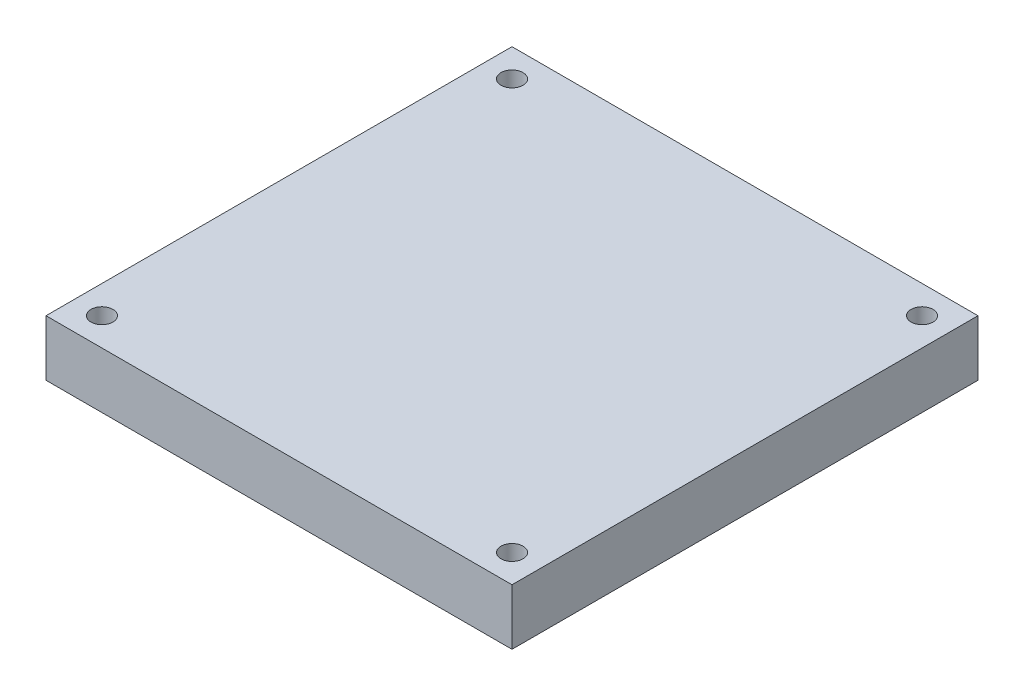
ISO-10303-21;
HEADER;
FILE_DESCRIPTION(('STEP AP214'),'2;1');
FILE_NAME('part.step','',(''),(''),'','','');
FILE_SCHEMA(('AUTOMOTIVE_DESIGN { 1 0 10303 214 1 1 1 1 }'));
ENDSEC;
DATA;
#1=APPLICATION_CONTEXT('core data for automotive mechanical design processes');
#2=APPLICATION_PROTOCOL_DEFINITION('international standard','automotive_design',2000,#1);
#3=PRODUCT_CONTEXT('',#1,'mechanical');
#4=PRODUCT('Part','Part','',(#3));
#5=PRODUCT_RELATED_PRODUCT_CATEGORY('part','',(#4));
#6=PRODUCT_DEFINITION_FORMATION('','',#4);
#7=PRODUCT_DEFINITION_CONTEXT('part definition',#1,'design');
#8=PRODUCT_DEFINITION('design','',#6,#7);
#9=PRODUCT_DEFINITION_SHAPE('','',#8);
#10=(LENGTH_UNIT() NAMED_UNIT(*) SI_UNIT(.MILLI.,.METRE.));
#11=(NAMED_UNIT(*) PLANE_ANGLE_UNIT() SI_UNIT($,.RADIAN.));
#12=(NAMED_UNIT(*) SI_UNIT($,.STERADIAN.) SOLID_ANGLE_UNIT());
#13=UNCERTAINTY_MEASURE_WITH_UNIT(LENGTH_MEASURE(1.E-05),#10,'distance_accuracy_value','');
#14=(GEOMETRIC_REPRESENTATION_CONTEXT(3) GLOBAL_UNCERTAINTY_ASSIGNED_CONTEXT((#13)) GLOBAL_UNIT_ASSIGNED_CONTEXT((#10,
#11,#12)) REPRESENTATION_CONTEXT('',''));
#15=CARTESIAN_POINT('',(0.,0.,0.));
#16=DIRECTION('',(0.,0.,1.));
#17=DIRECTION('',(1.,0.,0.));
#18=AXIS2_PLACEMENT_3D('',#15,#16,#17);
#19=CARTESIAN_POINT('',(-27.94,0.,-27.94));
#20=DIRECTION('',(0.,-1.,0.));
#21=DIRECTION('',(0.,0.,-1.));
#22=AXIS2_PLACEMENT_3D('',#19,#20,#21);
#23=CONICAL_SURFACE('',#22,1.525,0.785398163397388);
#24=CARTESIAN_POINT('',(-27.94,0.0250000000000003,-27.94));
#25=DIRECTION('',(0.,-1.,0.));
#26=DIRECTION('',(0.,0.,-1.));
#27=AXIS2_PLACEMENT_3D('',#24,#25,#26);
#28=CIRCLE('',#27,1.5);
#29=CARTESIAN_POINT('',(-27.94,0.0250000000000003,-29.44));
#30=VERTEX_POINT('',#29);
#31=EDGE_CURVE('E11',#30,#30,#28,.T.);
#32=ORIENTED_EDGE('',*,*,#31,.F.);
#33=EDGE_LOOP('',(#32));
#34=FACE_BOUND('',#33,.T.);
#35=CARTESIAN_POINT('',(-27.94,0.,-27.94));
#36=DIRECTION('',(0.,-1.,0.));
#37=DIRECTION('',(0.,0.,-1.));
#38=AXIS2_PLACEMENT_3D('',#35,#36,#37);
#39=CIRCLE('',#38,1.525);
#40=CARTESIAN_POINT('',(-27.94,0.,-29.465));
#41=VERTEX_POINT('',#40);
#42=EDGE_CURVE('E145',#41,#41,#39,.T.);
#43=ORIENTED_EDGE('',*,*,#42,.T.);
#44=EDGE_LOOP('',(#43));
#45=FACE_BOUND('',#44,.T.);
#46=ADVANCED_FACE('F43',(#34,#45),#23,.F.);
#47=CARTESIAN_POINT('',(-27.94,0.,-27.94));
#48=DIRECTION('',(0.,-1.,0.));
#49=DIRECTION('',(0.,0.,-1.));
#50=AXIS2_PLACEMENT_3D('',#47,#48,#49);
#51=CYLINDRICAL_SURFACE('',#50,1.5);
#52=CARTESIAN_POINT('',(-27.94,7.62,-27.94));
#53=DIRECTION('',(0.,-1.,0.));
#54=DIRECTION('',(0.,0.,-1.));
#55=AXIS2_PLACEMENT_3D('',#52,#53,#54);
#56=CIRCLE('',#55,1.5);
#57=CARTESIAN_POINT('',(-27.94,7.62,-29.44));
#58=VERTEX_POINT('',#57);
#59=EDGE_CURVE('E52',#58,#58,#56,.T.);
#60=ORIENTED_EDGE('',*,*,#59,.F.);
#61=EDGE_LOOP('',(#60));
#62=FACE_BOUND('',#61,.T.);
#63=ORIENTED_EDGE('',*,*,#31,.T.);
#64=EDGE_LOOP('',(#63));
#65=FACE_BOUND('',#64,.T.);
#66=ADVANCED_FACE('F153',(#62,#65),#51,.F.);
#67=CARTESIAN_POINT('',(-27.94,0.,27.94));
#68=DIRECTION('',(0.,-1.,0.));
#69=DIRECTION('',(0.,0.,-1.));
#70=AXIS2_PLACEMENT_3D('',#67,#68,#69);
#71=CONICAL_SURFACE('',#70,1.525,0.785398163397388);
#72=CARTESIAN_POINT('',(-27.94,0.0250000000000003,27.94));
#73=DIRECTION('',(0.,-1.,0.));
#74=DIRECTION('',(0.,0.,-1.));
#75=AXIS2_PLACEMENT_3D('',#72,#73,#74);
#76=CIRCLE('',#75,1.5);
#77=CARTESIAN_POINT('',(-27.94,0.0250000000000003,26.44));
#78=VERTEX_POINT('',#77);
#79=EDGE_CURVE('E141',#78,#78,#76,.T.);
#80=ORIENTED_EDGE('',*,*,#79,.F.);
#81=EDGE_LOOP('',(#80));
#82=FACE_BOUND('',#81,.T.);
#83=CARTESIAN_POINT('',(-27.94,0.,27.94));
#84=DIRECTION('',(0.,-1.,0.));
#85=DIRECTION('',(0.,0.,-1.));
#86=AXIS2_PLACEMENT_3D('',#83,#84,#85);
#87=CIRCLE('',#86,1.525);
#88=CARTESIAN_POINT('',(-27.94,0.,26.415));
#89=VERTEX_POINT('',#88);
#90=EDGE_CURVE('E133',#89,#89,#87,.T.);
#91=ORIENTED_EDGE('',*,*,#90,.T.);
#92=EDGE_LOOP('',(#91));
#93=FACE_BOUND('',#92,.T.);
#94=ADVANCED_FACE('F156',(#82,#93),#71,.F.);
#95=CARTESIAN_POINT('',(-27.94,0.,27.94));
#96=DIRECTION('',(0.,-1.,0.));
#97=DIRECTION('',(0.,0.,-1.));
#98=AXIS2_PLACEMENT_3D('',#95,#96,#97);
#99=CYLINDRICAL_SURFACE('',#98,1.5);
#100=CARTESIAN_POINT('',(-27.94,7.62,27.94));
#101=DIRECTION('',(0.,-1.,0.));
#102=DIRECTION('',(0.,0.,-1.));
#103=AXIS2_PLACEMENT_3D('',#100,#101,#102);
#104=CIRCLE('',#103,1.5);
#105=CARTESIAN_POINT('',(-27.94,7.62,26.44));
#106=VERTEX_POINT('',#105);
#107=EDGE_CURVE('E137',#106,#106,#104,.T.);
#108=ORIENTED_EDGE('',*,*,#107,.F.);
#109=EDGE_LOOP('',(#108));
#110=FACE_BOUND('',#109,.T.);
#111=ORIENTED_EDGE('',*,*,#79,.T.);
#112=EDGE_LOOP('',(#111));
#113=FACE_BOUND('',#112,.T.);
#114=ADVANCED_FACE('F190',(#110,#113),#99,.F.);
#115=CARTESIAN_POINT('',(31.75,7.62,31.75));
#116=DIRECTION('',(-1.,0.,0.));
#117=DIRECTION('',(0.,0.,1.));
#118=AXIS2_PLACEMENT_3D('',#115,#116,#117);
#119=PLANE('',#118);
#120=DIRECTION('',(0.,0.,-1.));
#121=VECTOR('',#120,1.);
#122=CARTESIAN_POINT('',(31.75,0.,31.75));
#123=LINE('',#122,#121);
#124=CARTESIAN_POINT('',(31.75,0.,31.75));
#125=VERTEX_POINT('',#124);
#126=CARTESIAN_POINT('',(31.75,0.,-31.75));
#127=VERTEX_POINT('',#126);
#128=EDGE_CURVE('E116',#125,#127,#123,.T.);
#129=ORIENTED_EDGE('',*,*,#128,.T.);
#130=DIRECTION('',(0.,-1.,0.));
#131=VECTOR('',#130,1.);
#132=CARTESIAN_POINT('',(31.75,7.62,-31.75));
#133=LINE('',#132,#131);
#134=CARTESIAN_POINT('',(31.75,7.62,-31.75));
#135=VERTEX_POINT('',#134);
#136=EDGE_CURVE('E105',#135,#127,#133,.T.);
#137=ORIENTED_EDGE('',*,*,#136,.F.);
#138=DIRECTION('',(0.,0.,-1.));
#139=VECTOR('',#138,1.);
#140=CARTESIAN_POINT('',(31.75,7.62,31.75));
#141=LINE('',#140,#139);
#142=CARTESIAN_POINT('',(31.75,7.62,31.75));
#143=VERTEX_POINT('',#142);
#144=EDGE_CURVE('E97',#143,#135,#141,.T.);
#145=ORIENTED_EDGE('',*,*,#144,.F.);
#146=DIRECTION('',(0.,-1.,0.));
#147=VECTOR('',#146,1.);
#148=CARTESIAN_POINT('',(31.75,7.62,31.75));
#149=LINE('',#148,#147);
#150=EDGE_CURVE('E112',#143,#125,#149,.T.);
#151=ORIENTED_EDGE('',*,*,#150,.T.);
#152=EDGE_LOOP('',(#129,#137,#145,#151));
#153=FACE_BOUND('',#152,.T.);
#154=ADVANCED_FACE('F187',(#153),#119,.F.);
#155=CARTESIAN_POINT('',(-31.75,7.62,-31.75));
#156=DIRECTION('',(0.,0.,1.));
#157=DIRECTION('',(1.,0.,0.));
#158=AXIS2_PLACEMENT_3D('',#155,#156,#157);
#159=PLANE('',#158);
#160=DIRECTION('',(-1.,0.,0.));
#161=VECTOR('',#160,1.);
#162=CARTESIAN_POINT('',(-31.75,0.,-31.75));
#163=LINE('',#162,#161);
#164=CARTESIAN_POINT('',(-31.75,0.,-31.75));
#165=VERTEX_POINT('',#164);
#166=EDGE_CURVE('E103',#127,#165,#163,.T.);
#167=ORIENTED_EDGE('',*,*,#166,.T.);
#168=DIRECTION('',(0.,-1.,0.));
#169=VECTOR('',#168,1.);
#170=CARTESIAN_POINT('',(-31.75,7.62,-31.75));
#171=LINE('',#170,#169);
#172=CARTESIAN_POINT('',(-31.75,7.62,-31.75));
#173=VERTEX_POINT('',#172);
#174=EDGE_CURVE('E101',#173,#165,#171,.T.);
#175=ORIENTED_EDGE('',*,*,#174,.F.);
#176=DIRECTION('',(-1.,0.,0.));
#177=VECTOR('',#176,1.);
#178=CARTESIAN_POINT('',(-31.75,7.62,-31.75));
#179=LINE('',#178,#177);
#180=EDGE_CURVE('E91',#135,#173,#179,.T.);
#181=ORIENTED_EDGE('',*,*,#180,.F.);
#182=ORIENTED_EDGE('',*,*,#136,.T.);
#183=EDGE_LOOP('',(#167,#175,#181,#182));
#184=FACE_BOUND('',#183,.T.);
#185=ADVANCED_FACE('F102',(#184),#159,.F.);
#186=CARTESIAN_POINT('',(-31.75,7.62,31.75));
#187=DIRECTION('',(1.,0.,0.));
#188=DIRECTION('',(0.,0.,-1.));
#189=AXIS2_PLACEMENT_3D('',#186,#187,#188);
#190=PLANE('',#189);
#191=DIRECTION('',(0.,0.,1.));
#192=VECTOR('',#191,1.);
#193=CARTESIAN_POINT('',(-31.75,0.,31.75));
#194=LINE('',#193,#192);
#195=CARTESIAN_POINT('',(-31.75,0.,31.75));
#196=VERTEX_POINT('',#195);
#197=EDGE_CURVE('E77',#165,#196,#194,.T.);
#198=ORIENTED_EDGE('',*,*,#197,.T.);
#199=DIRECTION('',(0.,-1.,0.));
#200=VECTOR('',#199,1.);
#201=CARTESIAN_POINT('',(-31.75,7.62,31.75));
#202=LINE('',#201,#200);
#203=CARTESIAN_POINT('',(-31.75,7.62,31.75));
#204=VERTEX_POINT('',#203);
#205=EDGE_CURVE('E106',#204,#196,#202,.T.);
#206=ORIENTED_EDGE('',*,*,#205,.F.);
#207=DIRECTION('',(0.,0.,1.));
#208=VECTOR('',#207,1.);
#209=CARTESIAN_POINT('',(-31.75,7.62,31.75));
#210=LINE('',#209,#208);
#211=EDGE_CURVE('E95',#173,#204,#210,.T.);
#212=ORIENTED_EDGE('',*,*,#211,.F.);
#213=ORIENTED_EDGE('',*,*,#174,.T.);
#214=EDGE_LOOP('',(#198,#206,#212,#213));
#215=FACE_BOUND('',#214,.T.);
#216=ADVANCED_FACE('F108',(#215),#190,.F.);
#217=CARTESIAN_POINT('',(-31.75,7.62,31.75));
#218=DIRECTION('',(0.,0.,-1.));
#219=DIRECTION('',(-1.,0.,0.));
#220=AXIS2_PLACEMENT_3D('',#217,#218,#219);
#221=PLANE('',#220);
#222=DIRECTION('',(1.,0.,0.));
#223=VECTOR('',#222,1.);
#224=CARTESIAN_POINT('',(-31.75,0.,31.75));
#225=LINE('',#224,#223);
#226=EDGE_CURVE('E83',#196,#125,#225,.T.);
#227=ORIENTED_EDGE('',*,*,#226,.T.);
#228=ORIENTED_EDGE('',*,*,#150,.F.);
#229=DIRECTION('',(1.,0.,0.));
#230=VECTOR('',#229,1.);
#231=CARTESIAN_POINT('',(-31.75,7.62,31.75));
#232=LINE('',#231,#230);
#233=EDGE_CURVE('E60',#204,#143,#232,.T.);
#234=ORIENTED_EDGE('',*,*,#233,.F.);
#235=ORIENTED_EDGE('',*,*,#205,.T.);
#236=EDGE_LOOP('',(#227,#228,#234,#235));
#237=FACE_BOUND('',#236,.T.);
#238=ADVANCED_FACE('F175',(#237),#221,.F.);
#239=CARTESIAN_POINT('',(0.,7.62,0.));
#240=DIRECTION('',(0.,-1.,0.));
#241=DIRECTION('',(0.,0.,-1.));
#242=AXIS2_PLACEMENT_3D('',#239,#240,#241);
#243=PLANE('',#242);
#244=CARTESIAN_POINT('',(27.94,7.62,-27.94));
#245=DIRECTION('',(0.,-1.,0.));
#246=DIRECTION('',(0.,0.,-1.));
#247=AXIS2_PLACEMENT_3D('',#244,#245,#246);
#248=CIRCLE('',#247,1.5);
#249=CARTESIAN_POINT('',(27.94,7.62,-29.44));
#250=VERTEX_POINT('',#249);
#251=EDGE_CURVE('E362',#250,#250,#248,.T.);
#252=ORIENTED_EDGE('',*,*,#251,.T.);
#253=EDGE_LOOP('',(#252));
#254=FACE_BOUND('',#253,.T.);
#255=CARTESIAN_POINT('',(27.94,7.62,27.94));
#256=DIRECTION('',(0.,-1.,0.));
#257=DIRECTION('',(0.,0.,-1.));
#258=AXIS2_PLACEMENT_3D('',#255,#256,#257);
#259=CIRCLE('',#258,1.5);
#260=CARTESIAN_POINT('',(27.94,7.62,26.44));
#261=VERTEX_POINT('',#260);
#262=EDGE_CURVE('E120',#261,#261,#259,.T.);
#263=ORIENTED_EDGE('',*,*,#262,.T.);
#264=EDGE_LOOP('',(#263));
#265=FACE_BOUND('',#264,.T.);
#266=ORIENTED_EDGE('',*,*,#144,.T.);
#267=ORIENTED_EDGE('',*,*,#180,.T.);
#268=ORIENTED_EDGE('',*,*,#211,.T.);
#269=ORIENTED_EDGE('',*,*,#233,.T.);
#270=EDGE_LOOP('',(#266,#267,#268,#269));
#271=FACE_BOUND('',#270,.T.);
#272=ORIENTED_EDGE('',*,*,#107,.T.);
#273=EDGE_LOOP('',(#272));
#274=FACE_BOUND('',#273,.T.);
#275=ORIENTED_EDGE('',*,*,#59,.T.);
#276=EDGE_LOOP('',(#275));
#277=FACE_BOUND('',#276,.T.);
#278=ADVANCED_FACE('F92',(#254,#265,#271,#274,#277),#243,.F.);
#279=CARTESIAN_POINT('',(0.,0.,0.));
#280=DIRECTION('',(0.,-1.,0.));
#281=DIRECTION('',(0.,0.,-1.));
#282=AXIS2_PLACEMENT_3D('',#279,#280,#281);
#283=PLANE('',#282);
#284=CARTESIAN_POINT('',(0.,0.,0.));
#285=DIRECTION('',(0.,-1.,0.));
#286=DIRECTION('',(0.,0.,-1.));
#287=AXIS2_PLACEMENT_3D('',#284,#285,#286);
#288=CIRCLE('',#287,12.7);
#289=CARTESIAN_POINT('',(0.,0.,-12.7));
#290=VERTEX_POINT('',#289);
#291=EDGE_CURVE('E380',#290,#290,#288,.T.);
#292=ORIENTED_EDGE('',*,*,#291,.F.);
#293=EDGE_LOOP('',(#292));
#294=FACE_BOUND('',#293,.T.);
#295=CARTESIAN_POINT('',(27.94,0.,-27.94));
#296=DIRECTION('',(0.,-1.,0.));
#297=DIRECTION('',(0.,0.,-1.));
#298=AXIS2_PLACEMENT_3D('',#295,#296,#297);
#299=CIRCLE('',#298,1.525);
#300=CARTESIAN_POINT('',(27.94,0.,-29.465));
#301=VERTEX_POINT('',#300);
#302=EDGE_CURVE('E375',#301,#301,#299,.T.);
#303=ORIENTED_EDGE('',*,*,#302,.F.);
#304=EDGE_LOOP('',(#303));
#305=FACE_BOUND('',#304,.T.);
#306=CARTESIAN_POINT('',(27.94,0.,27.94));
#307=DIRECTION('',(0.,-1.,0.));
#308=DIRECTION('',(0.,0.,-1.));
#309=AXIS2_PLACEMENT_3D('',#306,#307,#308);
#310=CIRCLE('',#309,1.525);
#311=CARTESIAN_POINT('',(27.94,0.,26.415));
#312=VERTEX_POINT('',#311);
#313=EDGE_CURVE('E353',#312,#312,#310,.T.);
#314=ORIENTED_EDGE('',*,*,#313,.F.);
#315=EDGE_LOOP('',(#314));
#316=FACE_BOUND('',#315,.T.);
#317=ORIENTED_EDGE('',*,*,#128,.F.);
#318=ORIENTED_EDGE('',*,*,#226,.F.);
#319=ORIENTED_EDGE('',*,*,#197,.F.);
#320=ORIENTED_EDGE('',*,*,#166,.F.);
#321=EDGE_LOOP('',(#317,#318,#319,#320));
#322=FACE_BOUND('',#321,.T.);
#323=ORIENTED_EDGE('',*,*,#90,.F.);
#324=EDGE_LOOP('',(#323));
#325=FACE_BOUND('',#324,.T.);
#326=ORIENTED_EDGE('',*,*,#42,.F.);
#327=EDGE_LOOP('',(#326));
#328=FACE_BOUND('',#327,.T.);
#329=ADVANCED_FACE('F163',(#294,#305,#316,#322,#325,#328),#283,.T.);
#330=CARTESIAN_POINT('',(27.94,0.,27.94));
#331=DIRECTION('',(0.,-1.,0.));
#332=DIRECTION('',(0.,0.,-1.));
#333=AXIS2_PLACEMENT_3D('',#330,#331,#332);
#334=CYLINDRICAL_SURFACE('',#333,1.5);
#335=ORIENTED_EDGE('',*,*,#262,.F.);
#336=EDGE_LOOP('',(#335));
#337=FACE_BOUND('',#336,.T.);
#338=CARTESIAN_POINT('',(27.94,0.0250000000000003,27.94));
#339=DIRECTION('',(0.,-1.,0.));
#340=DIRECTION('',(0.,0.,-1.));
#341=AXIS2_PLACEMENT_3D('',#338,#339,#340);
#342=CIRCLE('',#341,1.5);
#343=CARTESIAN_POINT('',(27.94,0.0250000000000003,26.44));
#344=VERTEX_POINT('',#343);
#345=EDGE_CURVE('E350',#344,#344,#342,.T.);
#346=ORIENTED_EDGE('',*,*,#345,.T.);
#347=EDGE_LOOP('',(#346));
#348=FACE_BOUND('',#347,.T.);
#349=ADVANCED_FACE('F165',(#337,#348),#334,.F.);
#350=CARTESIAN_POINT('',(27.94,0.,27.94));
#351=DIRECTION('',(0.,-1.,0.));
#352=DIRECTION('',(0.,0.,-1.));
#353=AXIS2_PLACEMENT_3D('',#350,#351,#352);
#354=CONICAL_SURFACE('',#353,1.525,0.785398163397388);
#355=ORIENTED_EDGE('',*,*,#345,.F.);
#356=EDGE_LOOP('',(#355));
#357=FACE_BOUND('',#356,.T.);
#358=ORIENTED_EDGE('',*,*,#313,.T.);
#359=EDGE_LOOP('',(#358));
#360=FACE_BOUND('',#359,.T.);
#361=ADVANCED_FACE('F172',(#357,#360),#354,.F.);
#362=CARTESIAN_POINT('',(27.94,0.,-27.94));
#363=DIRECTION('',(0.,-1.,0.));
#364=DIRECTION('',(0.,0.,-1.));
#365=AXIS2_PLACEMENT_3D('',#362,#363,#364);
#366=CYLINDRICAL_SURFACE('',#365,1.5);
#367=ORIENTED_EDGE('',*,*,#251,.F.);
#368=EDGE_LOOP('',(#367));
#369=FACE_BOUND('',#368,.T.);
#370=CARTESIAN_POINT('',(27.94,0.0250000000000003,-27.94));
#371=DIRECTION('',(0.,-1.,0.));
#372=DIRECTION('',(0.,0.,-1.));
#373=AXIS2_PLACEMENT_3D('',#370,#371,#372);
#374=CIRCLE('',#373,1.5);
#375=CARTESIAN_POINT('',(27.94,0.0250000000000003,-29.44));
#376=VERTEX_POINT('',#375);
#377=EDGE_CURVE('E356',#376,#376,#374,.T.);
#378=ORIENTED_EDGE('',*,*,#377,.T.);
#379=EDGE_LOOP('',(#378));
#380=FACE_BOUND('',#379,.T.);
#381=ADVANCED_FACE('F238',(#369,#380),#366,.F.);
#382=CARTESIAN_POINT('',(27.94,0.,-27.94));
#383=DIRECTION('',(0.,-1.,0.));
#384=DIRECTION('',(0.,0.,-1.));
#385=AXIS2_PLACEMENT_3D('',#382,#383,#384);
#386=CONICAL_SURFACE('',#385,1.525,0.785398163397388);
#387=ORIENTED_EDGE('',*,*,#377,.F.);
#388=EDGE_LOOP('',(#387));
#389=FACE_BOUND('',#388,.T.);
#390=ORIENTED_EDGE('',*,*,#302,.T.);
#391=EDGE_LOOP('',(#390));
#392=FACE_BOUND('',#391,.T.);
#393=ADVANCED_FACE('F243',(#389,#392),#386,.F.);
#394=CARTESIAN_POINT('',(0.,6.35,0.));
#395=DIRECTION('',(0.,-1.,0.));
#396=DIRECTION('',(0.,0.,-1.));
#397=AXIS2_PLACEMENT_3D('',#394,#395,#396);
#398=CYLINDRICAL_SURFACE('',#397,12.7);
#399=CARTESIAN_POINT('',(0.,6.35,0.));
#400=DIRECTION('',(0.,-1.,0.));
#401=DIRECTION('',(0.,0.,-1.));
#402=AXIS2_PLACEMENT_3D('',#399,#400,#401);
#403=CIRCLE('',#402,12.7);
#404=CARTESIAN_POINT('',(0.,6.35,-12.7));
#405=VERTEX_POINT('',#404);
#406=EDGE_CURVE('E379',#405,#405,#403,.T.);
#407=ORIENTED_EDGE('',*,*,#406,.F.);
#408=EDGE_LOOP('',(#407));
#409=FACE_BOUND('',#408,.T.);
#410=ORIENTED_EDGE('',*,*,#291,.T.);
#411=EDGE_LOOP('',(#410));
#412=FACE_BOUND('',#411,.T.);
#413=ADVANCED_FACE('F254',(#409,#412),#398,.F.);
#414=CARTESIAN_POINT('',(0.,6.35,0.));
#415=DIRECTION('',(0.,-1.,0.));
#416=DIRECTION('',(0.,0.,-1.));
#417=AXIS2_PLACEMENT_3D('',#414,#415,#416);
#418=PLANE('',#417);
#419=ORIENTED_EDGE('',*,*,#406,.T.);
#420=EDGE_LOOP('',(#419));
#421=FACE_BOUND('',#420,.T.);
#422=ADVANCED_FACE('F271',(#421),#418,.T.);
#423=CLOSED_SHELL('',(#46,#66,#94,#114,#154,#185,#216,#238,#278,#329,#349,#361,#381,#393,#413,#422));
#424=MANIFOLD_SOLID_BREP('B2',#423);
#425=ADVANCED_BREP_SHAPE_REPRESENTATION('',(#18,#424),#14);
#426=SHAPE_DEFINITION_REPRESENTATION(#9,#425);
ENDSEC;
END-ISO-10303-21;
